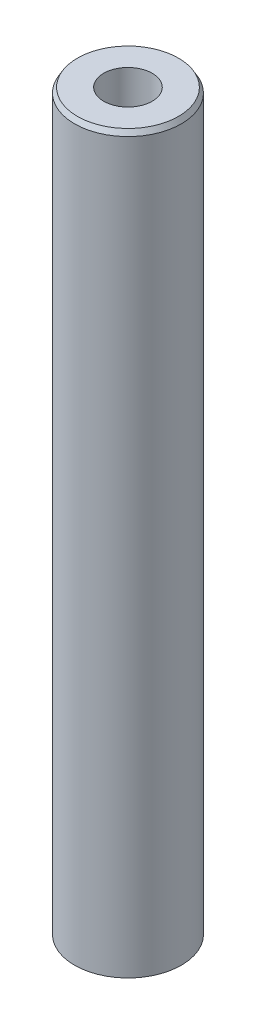
ISO-10303-21;
HEADER;
FILE_DESCRIPTION(('STEP AP214'),'2;1');
FILE_NAME('part.step','',(''),(''),'','','');
FILE_SCHEMA(('AUTOMOTIVE_DESIGN { 1 0 10303 214 1 1 1 1 }'));
ENDSEC;
DATA;
#1=APPLICATION_CONTEXT('core data for automotive mechanical design processes');
#2=APPLICATION_PROTOCOL_DEFINITION('international standard','automotive_design',2000,#1);
#3=PRODUCT_CONTEXT('',#1,'mechanical');
#4=PRODUCT('Part','Part','',(#3));
#5=PRODUCT_RELATED_PRODUCT_CATEGORY('part','',(#4));
#6=PRODUCT_DEFINITION_FORMATION('','',#4);
#7=PRODUCT_DEFINITION_CONTEXT('part definition',#1,'design');
#8=PRODUCT_DEFINITION('design','',#6,#7);
#9=PRODUCT_DEFINITION_SHAPE('','',#8);
#10=(LENGTH_UNIT() NAMED_UNIT(*) SI_UNIT(.MILLI.,.METRE.));
#11=(NAMED_UNIT(*) PLANE_ANGLE_UNIT() SI_UNIT($,.RADIAN.));
#12=(NAMED_UNIT(*) SI_UNIT($,.STERADIAN.) SOLID_ANGLE_UNIT());
#13=UNCERTAINTY_MEASURE_WITH_UNIT(LENGTH_MEASURE(1.E-05),#10,'distance_accuracy_value','');
#14=(GEOMETRIC_REPRESENTATION_CONTEXT(3) GLOBAL_UNCERTAINTY_ASSIGNED_CONTEXT((#13)) GLOBAL_UNIT_ASSIGNED_CONTEXT((#10,
#11,#12)) REPRESENTATION_CONTEXT('',''));
#15=CARTESIAN_POINT('',(0.,0.,0.));
#16=DIRECTION('',(0.,0.,1.));
#17=DIRECTION('',(1.,0.,0.));
#18=AXIS2_PLACEMENT_3D('',#15,#16,#17);
#19=CARTESIAN_POINT('',(0.,68.9585278135219,0.));
#20=DIRECTION('',(0.,-1.,0.));
#21=DIRECTION('',(0.,0.,-1.));
#22=AXIS2_PLACEMENT_3D('',#19,#20,#21);
#23=CYLINDRICAL_SURFACE('',#22,5.);
#24=CARTESIAN_POINT('',(0.,68.4916652005174,0.));
#25=DIRECTION('',(0.,1.,0.));
#26=DIRECTION('',(0.,0.,1.));
#27=AXIS2_PLACEMENT_3D('',#24,#25,#26);
#28=CIRCLE('',#27,5.);
#29=CARTESIAN_POINT('',(0.,68.4916652005174,5.));
#30=VERTEX_POINT('',#29);
#31=EDGE_CURVE('E50',#30,#30,#28,.F.);
#32=ORIENTED_EDGE('',*,*,#31,.T.);
#33=EDGE_LOOP('',(#32));
#34=FACE_BOUND('',#33,.T.);
#35=CARTESIAN_POINT('',(0.,0.269543255292701,0.));
#36=DIRECTION('',(0.,1.,0.));
#37=DIRECTION('',(0.,0.,1.));
#38=AXIS2_PLACEMENT_3D('',#35,#36,#37);
#39=CIRCLE('',#38,5.);
#40=CARTESIAN_POINT('',(0.,0.269543255292701,5.));
#41=VERTEX_POINT('',#40);
#42=EDGE_CURVE('E51',#41,#41,#39,.T.);
#43=ORIENTED_EDGE('',*,*,#42,.T.);
#44=EDGE_LOOP('',(#43));
#45=FACE_BOUND('',#44,.T.);
#46=ADVANCED_FACE('F39',(#34,#45),#23,.T.);
#47=CARTESIAN_POINT('',(0.,68.9585278135219,0.));
#48=DIRECTION('',(0.,1.,0.));
#49=DIRECTION('',(0.,0.,1.));
#50=AXIS2_PLACEMENT_3D('',#47,#48,#49);
#51=PLANE('',#50);
#52=CARTESIAN_POINT('',(0.,68.9585278135219,0.));
#53=DIRECTION('',(0.,1.,0.));
#54=DIRECTION('',(0.,0.,1.));
#55=AXIS2_PLACEMENT_3D('',#52,#53,#54);
#56=CIRCLE('',#55,4.73045674470728);
#57=CARTESIAN_POINT('',(0.,68.9585278135219,4.73045674470728));
#58=VERTEX_POINT('',#57);
#59=EDGE_CURVE('E54',#58,#58,#56,.T.);
#60=ORIENTED_EDGE('',*,*,#59,.T.);
#61=EDGE_LOOP('',(#60));
#62=FACE_BOUND('',#61,.T.);
#63=CARTESIAN_POINT('',(0.,68.9585278135219,0.));
#64=DIRECTION('',(0.,1.,0.));
#65=DIRECTION('',(0.,0.,1.));
#66=AXIS2_PLACEMENT_3D('',#63,#64,#65);
#67=CIRCLE('',#66,2.27240547071934);
#68=CARTESIAN_POINT('',(0.,68.9585278135219,2.27240547071934));
#69=VERTEX_POINT('',#68);
#70=EDGE_CURVE('E58',#69,#69,#67,.T.);
#71=ORIENTED_EDGE('',*,*,#70,.F.);
#72=EDGE_LOOP('',(#71));
#73=FACE_BOUND('',#72,.T.);
#74=ADVANCED_FACE('F69',(#62,#73),#51,.T.);
#75=CARTESIAN_POINT('',(0.,0.,0.));
#76=DIRECTION('',(0.,1.,0.));
#77=DIRECTION('',(0.,0.,1.));
#78=AXIS2_PLACEMENT_3D('',#75,#76,#77);
#79=PLANE('',#78);
#80=CARTESIAN_POINT('',(0.,0.,0.));
#81=DIRECTION('',(0.,1.,0.));
#82=DIRECTION('',(0.,0.,1.));
#83=AXIS2_PLACEMENT_3D('',#80,#81,#82);
#84=CIRCLE('',#83,4.53313738699553);
#85=CARTESIAN_POINT('',(0.,0.,4.53313738699553));
#86=VERTEX_POINT('',#85);
#87=EDGE_CURVE('E10',#86,#86,#84,.F.);
#88=ORIENTED_EDGE('',*,*,#87,.T.);
#89=EDGE_LOOP('',(#88));
#90=FACE_BOUND('',#89,.T.);
#91=CARTESIAN_POINT('',(0.,0.,0.));
#92=DIRECTION('',(0.,1.,0.));
#93=DIRECTION('',(0.,0.,1.));
#94=AXIS2_PLACEMENT_3D('',#91,#92,#93);
#95=CIRCLE('',#94,2.27240547071934);
#96=CARTESIAN_POINT('',(0.,0.,2.27240547071934));
#97=VERTEX_POINT('',#96);
#98=EDGE_CURVE('E63',#97,#97,#95,.T.);
#99=ORIENTED_EDGE('',*,*,#98,.T.);
#100=EDGE_LOOP('',(#99));
#101=FACE_BOUND('',#100,.T.);
#102=ADVANCED_FACE('F75',(#90,#101),#79,.F.);
#103=CARTESIAN_POINT('',(0.,68.9585278135219,0.));
#104=DIRECTION('',(0.,-1.,0.));
#105=DIRECTION('',(0.,0.,-1.));
#106=AXIS2_PLACEMENT_3D('',#103,#104,#105);
#107=CYLINDRICAL_SURFACE('',#106,2.27240547071934);
#108=ORIENTED_EDGE('',*,*,#70,.T.);
#109=EDGE_LOOP('',(#108));
#110=FACE_BOUND('',#109,.T.);
#111=ORIENTED_EDGE('',*,*,#98,.F.);
#112=EDGE_LOOP('',(#111));
#113=FACE_BOUND('',#112,.T.);
#114=ADVANCED_FACE('F70',(#110,#113),#107,.F.);
#115=CARTESIAN_POINT('',(0.,68.9585278135219,0.));
#116=DIRECTION('',(0.,-1.,0.));
#117=DIRECTION('',(0.,0.,-1.));
#118=AXIS2_PLACEMENT_3D('',#115,#116,#117);
#119=CONICAL_SURFACE('',#118,4.73045674470728,0.523598775598299);
#120=ORIENTED_EDGE('',*,*,#31,.F.);
#121=EDGE_LOOP('',(#120));
#122=FACE_BOUND('',#121,.T.);
#123=ORIENTED_EDGE('',*,*,#59,.F.);
#124=EDGE_LOOP('',(#123));
#125=FACE_BOUND('',#124,.T.);
#126=ADVANCED_FACE('F81',(#122,#125),#119,.T.);
#127=CARTESIAN_POINT('',(0.,0.269543255292701,0.));
#128=DIRECTION('',(0.,1.,0.));
#129=DIRECTION('',(0.,0.,1.));
#130=AXIS2_PLACEMENT_3D('',#127,#128,#129);
#131=CONICAL_SURFACE('',#130,5.,1.04719755119661);
#132=ORIENTED_EDGE('',*,*,#87,.F.);
#133=EDGE_LOOP('',(#132));
#134=FACE_BOUND('',#133,.T.);
#135=ORIENTED_EDGE('',*,*,#42,.F.);
#136=EDGE_LOOP('',(#135));
#137=FACE_BOUND('',#136,.T.);
#138=ADVANCED_FACE('F45',(#134,#137),#131,.T.);
#139=CLOSED_SHELL('',(#46,#74,#102,#114,#126,#138));
#140=MANIFOLD_SOLID_BREP('B2',#139);
#141=ADVANCED_BREP_SHAPE_REPRESENTATION('',(#18,#140),#14);
#142=SHAPE_DEFINITION_REPRESENTATION(#9,#141);
ENDSEC;
END-ISO-10303-21;
